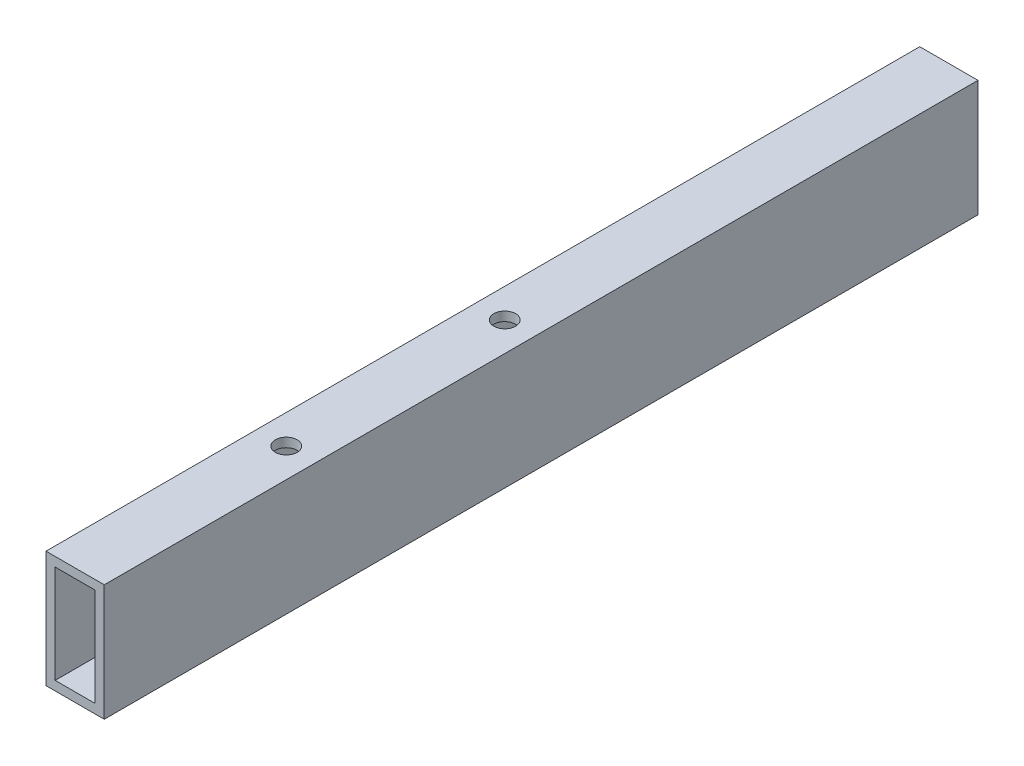
ISO-10303-21;
HEADER;
FILE_DESCRIPTION(('STEP AP214'),'2;1');
FILE_NAME('part.step','',(''),(''),'','','');
FILE_SCHEMA(('AUTOMOTIVE_DESIGN { 1 0 10303 214 1 1 1 1 }'));
ENDSEC;
DATA;
#1=APPLICATION_CONTEXT('core data for automotive mechanical design processes');
#2=APPLICATION_PROTOCOL_DEFINITION('international standard','automotive_design',2000,#1);
#3=PRODUCT_CONTEXT('',#1,'mechanical');
#4=PRODUCT('Part','Part','',(#3));
#5=PRODUCT_RELATED_PRODUCT_CATEGORY('part','',(#4));
#6=PRODUCT_DEFINITION_FORMATION('','',#4);
#7=PRODUCT_DEFINITION_CONTEXT('part definition',#1,'design');
#8=PRODUCT_DEFINITION('design','',#6,#7);
#9=PRODUCT_DEFINITION_SHAPE('','',#8);
#10=(LENGTH_UNIT() NAMED_UNIT(*) SI_UNIT(.MILLI.,.METRE.));
#11=(NAMED_UNIT(*) PLANE_ANGLE_UNIT() SI_UNIT($,.RADIAN.));
#12=(NAMED_UNIT(*) SI_UNIT($,.STERADIAN.) SOLID_ANGLE_UNIT());
#13=UNCERTAINTY_MEASURE_WITH_UNIT(LENGTH_MEASURE(1.E-05),#10,'distance_accuracy_value','');
#14=(GEOMETRIC_REPRESENTATION_CONTEXT(3) GLOBAL_UNCERTAINTY_ASSIGNED_CONTEXT((#13)) GLOBAL_UNIT_ASSIGNED_CONTEXT((#10,
#11,#12)) REPRESENTATION_CONTEXT('',''));
#15=CARTESIAN_POINT('',(0.,0.,0.));
#16=DIRECTION('',(0.,0.,1.));
#17=DIRECTION('',(1.,0.,0.));
#18=AXIS2_PLACEMENT_3D('',#15,#16,#17);
#19=CARTESIAN_POINT('',(-20.,40.,300.));
#20=DIRECTION('',(1.,0.,0.));
#21=DIRECTION('',(0.,0.,-1.));
#22=AXIS2_PLACEMENT_3D('',#19,#20,#21);
#23=PLANE('',#22);
#24=DIRECTION('',(0.,0.,-1.));
#25=VECTOR('',#24,1.);
#26=CARTESIAN_POINT('',(-20.,-40.,300.));
#27=LINE('',#26,#25);
#28=CARTESIAN_POINT('',(-20.,-40.,300.));
#29=VERTEX_POINT('',#28);
#30=CARTESIAN_POINT('',(-20.,-40.,-300.));
#31=VERTEX_POINT('',#30);
#32=EDGE_CURVE('E100',#29,#31,#27,.T.);
#33=ORIENTED_EDGE('',*,*,#32,.F.);
#34=DIRECTION('',(0.,-1.,0.));
#35=VECTOR('',#34,1.);
#36=CARTESIAN_POINT('',(-20.,40.,300.));
#37=LINE('',#36,#35);
#38=CARTESIAN_POINT('',(-20.,40.,300.));
#39=VERTEX_POINT('',#38);
#40=EDGE_CURVE('E88',#39,#29,#37,.T.);
#41=ORIENTED_EDGE('',*,*,#40,.F.);
#42=DIRECTION('',(0.,0.,-1.));
#43=VECTOR('',#42,1.);
#44=CARTESIAN_POINT('',(-20.,40.,300.));
#45=LINE('',#44,#43);
#46=CARTESIAN_POINT('',(-20.,40.,-300.));
#47=VERTEX_POINT('',#46);
#48=EDGE_CURVE('E105',#39,#47,#45,.T.);
#49=ORIENTED_EDGE('',*,*,#48,.T.);
#50=DIRECTION('',(0.,-1.,0.));
#51=VECTOR('',#50,1.);
#52=CARTESIAN_POINT('',(-20.,40.,-300.));
#53=LINE('',#52,#51);
#54=EDGE_CURVE('E101',#47,#31,#53,.T.);
#55=ORIENTED_EDGE('',*,*,#54,.T.);
#56=EDGE_LOOP('',(#33,#41,#49,#55));
#57=FACE_BOUND('',#56,.T.);
#58=ADVANCED_FACE('F36',(#57),#23,.F.);
#59=CARTESIAN_POINT('',(-20.,-40.,300.));
#60=DIRECTION('',(0.,1.,0.));
#61=DIRECTION('',(-1.,0.,0.));
#62=AXIS2_PLACEMENT_3D('',#59,#60,#61);
#63=PLANE('',#62);
#64=CARTESIAN_POINT('',(0.,-40.,155.));
#65=DIRECTION('',(0.,1.,0.));
#66=DIRECTION('',(0.,0.,1.));
#67=AXIS2_PLACEMENT_3D('',#64,#65,#66);
#68=CIRCLE('',#67,7.49999999999999);
#69=CARTESIAN_POINT('',(0.,-40.,162.5));
#70=VERTEX_POINT('',#69);
#71=EDGE_CURVE('E219',#70,#70,#68,.T.);
#72=ORIENTED_EDGE('',*,*,#71,.T.);
#73=EDGE_LOOP('',(#72));
#74=FACE_BOUND('',#73,.T.);
#75=CARTESIAN_POINT('',(0.,-40.,5.));
#76=DIRECTION('',(0.,1.,0.));
#77=DIRECTION('',(0.,0.,1.));
#78=AXIS2_PLACEMENT_3D('',#75,#76,#77);
#79=CIRCLE('',#78,7.49999999999999);
#80=CARTESIAN_POINT('',(0.,-40.,12.5));
#81=VERTEX_POINT('',#80);
#82=EDGE_CURVE('E124',#81,#81,#79,.T.);
#83=ORIENTED_EDGE('',*,*,#82,.T.);
#84=EDGE_LOOP('',(#83));
#85=FACE_BOUND('',#84,.T.);
#86=DIRECTION('',(0.,0.,-1.));
#87=VECTOR('',#86,1.);
#88=CARTESIAN_POINT('',(20.,-40.,300.));
#89=LINE('',#88,#87);
#90=CARTESIAN_POINT('',(20.,-40.,300.));
#91=VERTEX_POINT('',#90);
#92=CARTESIAN_POINT('',(20.,-40.,-300.));
#93=VERTEX_POINT('',#92);
#94=EDGE_CURVE('E104',#91,#93,#89,.T.);
#95=ORIENTED_EDGE('',*,*,#94,.F.);
#96=DIRECTION('',(1.,0.,0.));
#97=VECTOR('',#96,1.);
#98=CARTESIAN_POINT('',(-20.,-40.,300.));
#99=LINE('',#98,#97);
#100=EDGE_CURVE('E85',#29,#91,#99,.T.);
#101=ORIENTED_EDGE('',*,*,#100,.F.);
#102=ORIENTED_EDGE('',*,*,#32,.T.);
#103=DIRECTION('',(1.,0.,0.));
#104=VECTOR('',#103,1.);
#105=CARTESIAN_POINT('',(-20.,-40.,-300.));
#106=LINE('',#105,#104);
#107=EDGE_CURVE('E169',#31,#93,#106,.T.);
#108=ORIENTED_EDGE('',*,*,#107,.T.);
#109=EDGE_LOOP('',(#95,#101,#102,#108));
#110=FACE_BOUND('',#109,.T.);
#111=ADVANCED_FACE('F107',(#74,#85,#110),#63,.F.);
#112=CARTESIAN_POINT('',(20.,40.,300.));
#113=DIRECTION('',(-1.,0.,0.));
#114=DIRECTION('',(0.,-1.,0.));
#115=AXIS2_PLACEMENT_3D('',#112,#113,#114);
#116=PLANE('',#115);
#117=DIRECTION('',(0.,0.,-1.));
#118=VECTOR('',#117,1.);
#119=CARTESIAN_POINT('',(20.,40.,300.));
#120=LINE('',#119,#118);
#121=CARTESIAN_POINT('',(20.,40.,300.));
#122=VERTEX_POINT('',#121);
#123=CARTESIAN_POINT('',(20.,40.,-300.));
#124=VERTEX_POINT('',#123);
#125=EDGE_CURVE('E96',#122,#124,#120,.T.);
#126=ORIENTED_EDGE('',*,*,#125,.F.);
#127=DIRECTION('',(0.,1.,0.));
#128=VECTOR('',#127,1.);
#129=CARTESIAN_POINT('',(20.,40.,300.));
#130=LINE('',#129,#128);
#131=EDGE_CURVE('E110',#91,#122,#130,.T.);
#132=ORIENTED_EDGE('',*,*,#131,.F.);
#133=ORIENTED_EDGE('',*,*,#94,.T.);
#134=DIRECTION('',(0.,1.,0.));
#135=VECTOR('',#134,1.);
#136=CARTESIAN_POINT('',(20.,40.,-300.));
#137=LINE('',#136,#135);
#138=EDGE_CURVE('E114',#93,#124,#137,.T.);
#139=ORIENTED_EDGE('',*,*,#138,.T.);
#140=EDGE_LOOP('',(#126,#132,#133,#139));
#141=FACE_BOUND('',#140,.T.);
#142=ADVANCED_FACE('F176',(#141),#116,.F.);
#143=CARTESIAN_POINT('',(-20.,40.,300.));
#144=DIRECTION('',(0.,-1.,0.));
#145=DIRECTION('',(1.,0.,0.));
#146=AXIS2_PLACEMENT_3D('',#143,#144,#145);
#147=PLANE('',#146);
#148=CARTESIAN_POINT('',(0.,40.,155.));
#149=DIRECTION('',(0.,1.,0.));
#150=DIRECTION('',(0.,0.,1.));
#151=AXIS2_PLACEMENT_3D('',#148,#149,#150);
#152=CIRCLE('',#151,7.49999999999999);
#153=CARTESIAN_POINT('',(0.,40.,162.5));
#154=VERTEX_POINT('',#153);
#155=EDGE_CURVE('E221',#154,#154,#152,.T.);
#156=ORIENTED_EDGE('',*,*,#155,.F.);
#157=EDGE_LOOP('',(#156));
#158=FACE_BOUND('',#157,.T.);
#159=CARTESIAN_POINT('',(0.,40.,5.));
#160=DIRECTION('',(0.,1.,0.));
#161=DIRECTION('',(0.,0.,1.));
#162=AXIS2_PLACEMENT_3D('',#159,#160,#161);
#163=CIRCLE('',#162,7.49999999999999);
#164=CARTESIAN_POINT('',(0.,40.,12.5));
#165=VERTEX_POINT('',#164);
#166=EDGE_CURVE('E130',#165,#165,#163,.T.);
#167=ORIENTED_EDGE('',*,*,#166,.F.);
#168=EDGE_LOOP('',(#167));
#169=FACE_BOUND('',#168,.T.);
#170=DIRECTION('',(-1.,0.,0.));
#171=VECTOR('',#170,1.);
#172=CARTESIAN_POINT('',(-20.,40.,-300.));
#173=LINE('',#172,#171);
#174=EDGE_CURVE('E143',#124,#47,#173,.T.);
#175=ORIENTED_EDGE('',*,*,#174,.T.);
#176=ORIENTED_EDGE('',*,*,#48,.F.);
#177=DIRECTION('',(-1.,0.,0.));
#178=VECTOR('',#177,1.);
#179=CARTESIAN_POINT('',(-20.,40.,300.));
#180=LINE('',#179,#178);
#181=EDGE_CURVE('E92',#122,#39,#180,.T.);
#182=ORIENTED_EDGE('',*,*,#181,.F.);
#183=ORIENTED_EDGE('',*,*,#125,.T.);
#184=EDGE_LOOP('',(#175,#176,#182,#183));
#185=FACE_BOUND('',#184,.T.);
#186=ADVANCED_FACE('F38',(#158,#169,#185),#147,.F.);
#187=CARTESIAN_POINT('',(0.,0.,300.));
#188=DIRECTION('',(0.,0.,1.));
#189=DIRECTION('',(1.,0.,0.));
#190=AXIS2_PLACEMENT_3D('',#187,#188,#189);
#191=PLANE('',#190);
#192=DIRECTION('',(0.,-1.,0.));
#193=VECTOR('',#192,1.);
#194=CARTESIAN_POINT('',(-13.7,33.7,300.));
#195=LINE('',#194,#193);
#196=CARTESIAN_POINT('',(-13.7,-33.7,300.));
#197=VERTEX_POINT('',#196);
#198=CARTESIAN_POINT('',(-13.7,33.7,300.));
#199=VERTEX_POINT('',#198);
#200=EDGE_CURVE('E156',#197,#199,#195,.F.);
#201=ORIENTED_EDGE('',*,*,#200,.T.);
#202=DIRECTION('',(-1.,0.,0.));
#203=VECTOR('',#202,1.);
#204=CARTESIAN_POINT('',(-13.7,33.7,300.));
#205=LINE('',#204,#203);
#206=CARTESIAN_POINT('',(13.7,33.7,300.));
#207=VERTEX_POINT('',#206);
#208=EDGE_CURVE('E139',#199,#207,#205,.F.);
#209=ORIENTED_EDGE('',*,*,#208,.T.);
#210=DIRECTION('',(0.,1.,0.));
#211=VECTOR('',#210,1.);
#212=CARTESIAN_POINT('',(13.7,33.7,300.));
#213=LINE('',#212,#211);
#214=CARTESIAN_POINT('',(13.7,-33.7,300.));
#215=VERTEX_POINT('',#214);
#216=EDGE_CURVE('E142',#207,#215,#213,.F.);
#217=ORIENTED_EDGE('',*,*,#216,.T.);
#218=DIRECTION('',(1.,0.,0.));
#219=VECTOR('',#218,1.);
#220=CARTESIAN_POINT('',(-13.7,-33.7,300.));
#221=LINE('',#220,#219);
#222=EDGE_CURVE('E159',#215,#197,#221,.F.);
#223=ORIENTED_EDGE('',*,*,#222,.T.);
#224=EDGE_LOOP('',(#201,#209,#217,#223));
#225=FACE_BOUND('',#224,.T.);
#226=ORIENTED_EDGE('',*,*,#40,.T.);
#227=ORIENTED_EDGE('',*,*,#100,.T.);
#228=ORIENTED_EDGE('',*,*,#131,.T.);
#229=ORIENTED_EDGE('',*,*,#181,.T.);
#230=EDGE_LOOP('',(#226,#227,#228,#229));
#231=FACE_BOUND('',#230,.T.);
#232=ADVANCED_FACE('F90',(#225,#231),#191,.T.);
#233=CARTESIAN_POINT('',(0.,0.,-300.));
#234=DIRECTION('',(0.,0.,1.));
#235=DIRECTION('',(1.,0.,0.));
#236=AXIS2_PLACEMENT_3D('',#233,#234,#235);
#237=PLANE('',#236);
#238=DIRECTION('',(0.,-1.,0.));
#239=VECTOR('',#238,1.);
#240=CARTESIAN_POINT('',(-13.7,33.7,-300.));
#241=LINE('',#240,#239);
#242=CARTESIAN_POINT('',(-13.7,-33.7,-300.));
#243=VERTEX_POINT('',#242);
#244=CARTESIAN_POINT('',(-13.7,33.7,-300.));
#245=VERTEX_POINT('',#244);
#246=EDGE_CURVE('E11',#243,#245,#241,.F.);
#247=ORIENTED_EDGE('',*,*,#246,.F.);
#248=DIRECTION('',(1.,0.,0.));
#249=VECTOR('',#248,1.);
#250=CARTESIAN_POINT('',(-13.7,-33.7,-300.));
#251=LINE('',#250,#249);
#252=CARTESIAN_POINT('',(13.7,-33.7,-300.));
#253=VERTEX_POINT('',#252);
#254=EDGE_CURVE('E46',#253,#243,#251,.F.);
#255=ORIENTED_EDGE('',*,*,#254,.F.);
#256=DIRECTION('',(0.,1.,0.));
#257=VECTOR('',#256,1.);
#258=CARTESIAN_POINT('',(13.7,33.7,-300.));
#259=LINE('',#258,#257);
#260=CARTESIAN_POINT('',(13.7,33.7,-300.));
#261=VERTEX_POINT('',#260);
#262=EDGE_CURVE('E147',#261,#253,#259,.F.);
#263=ORIENTED_EDGE('',*,*,#262,.F.);
#264=DIRECTION('',(-1.,0.,0.));
#265=VECTOR('',#264,1.);
#266=CARTESIAN_POINT('',(-13.7,33.7,-300.));
#267=LINE('',#266,#265);
#268=EDGE_CURVE('E144',#245,#261,#267,.F.);
#269=ORIENTED_EDGE('',*,*,#268,.F.);
#270=EDGE_LOOP('',(#247,#255,#263,#269));
#271=FACE_BOUND('',#270,.T.);
#272=ORIENTED_EDGE('',*,*,#54,.F.);
#273=ORIENTED_EDGE('',*,*,#174,.F.);
#274=ORIENTED_EDGE('',*,*,#138,.F.);
#275=ORIENTED_EDGE('',*,*,#107,.F.);
#276=EDGE_LOOP('',(#272,#273,#274,#275));
#277=FACE_BOUND('',#276,.T.);
#278=ADVANCED_FACE('F178',(#271,#277),#237,.F.);
#279=CARTESIAN_POINT('',(-13.7,33.7,300.));
#280=DIRECTION('',(0.,1.,0.));
#281=DIRECTION('',(-1.,0.,0.));
#282=AXIS2_PLACEMENT_3D('',#279,#280,#281);
#283=PLANE('',#282);
#284=CARTESIAN_POINT('',(0.,33.7,155.));
#285=DIRECTION('',(0.,1.,0.));
#286=DIRECTION('',(-1.,0.,0.));
#287=AXIS2_PLACEMENT_3D('',#284,#285,#286);
#288=CIRCLE('',#287,7.49999999999999);
#289=CARTESIAN_POINT('',(-7.49999999999999,33.7,155.));
#290=VERTEX_POINT('',#289);
#291=EDGE_CURVE('E40',#290,#290,#288,.T.);
#292=ORIENTED_EDGE('',*,*,#291,.T.);
#293=EDGE_LOOP('',(#292));
#294=FACE_BOUND('',#293,.T.);
#295=CARTESIAN_POINT('',(0.,33.7,5.));
#296=DIRECTION('',(0.,1.,0.));
#297=DIRECTION('',(-1.,0.,0.));
#298=AXIS2_PLACEMENT_3D('',#295,#296,#297);
#299=CIRCLE('',#298,7.49999999999999);
#300=CARTESIAN_POINT('',(-7.49999999999999,33.7,5.));
#301=VERTEX_POINT('',#300);
#302=EDGE_CURVE('E122',#301,#301,#299,.T.);
#303=ORIENTED_EDGE('',*,*,#302,.T.);
#304=EDGE_LOOP('',(#303));
#305=FACE_BOUND('',#304,.T.);
#306=DIRECTION('',(0.,0.,-1.));
#307=VECTOR('',#306,1.);
#308=CARTESIAN_POINT('',(13.7,33.7,300.));
#309=LINE('',#308,#307);
#310=EDGE_CURVE('E149',#207,#261,#309,.T.);
#311=ORIENTED_EDGE('',*,*,#310,.F.);
#312=ORIENTED_EDGE('',*,*,#208,.F.);
#313=DIRECTION('',(0.,0.,-1.));
#314=VECTOR('',#313,1.);
#315=CARTESIAN_POINT('',(-13.7,33.7,300.));
#316=LINE('',#315,#314);
#317=EDGE_CURVE('E153',#199,#245,#316,.T.);
#318=ORIENTED_EDGE('',*,*,#317,.T.);
#319=ORIENTED_EDGE('',*,*,#268,.T.);
#320=EDGE_LOOP('',(#311,#312,#318,#319));
#321=FACE_BOUND('',#320,.T.);
#322=ADVANCED_FACE('F208',(#294,#305,#321),#283,.F.);
#323=CARTESIAN_POINT('',(13.7,33.7,300.));
#324=DIRECTION('',(1.,0.,0.));
#325=DIRECTION('',(0.,0.,-1.));
#326=AXIS2_PLACEMENT_3D('',#323,#324,#325);
#327=PLANE('',#326);
#328=DIRECTION('',(0.,0.,-1.));
#329=VECTOR('',#328,1.);
#330=CARTESIAN_POINT('',(13.7,-33.7,300.));
#331=LINE('',#330,#329);
#332=EDGE_CURVE('E152',#215,#253,#331,.T.);
#333=ORIENTED_EDGE('',*,*,#332,.F.);
#334=ORIENTED_EDGE('',*,*,#216,.F.);
#335=ORIENTED_EDGE('',*,*,#310,.T.);
#336=ORIENTED_EDGE('',*,*,#262,.T.);
#337=EDGE_LOOP('',(#333,#334,#335,#336));
#338=FACE_BOUND('',#337,.T.);
#339=ADVANCED_FACE('F202',(#338),#327,.F.);
#340=CARTESIAN_POINT('',(-13.7,-33.7,300.));
#341=DIRECTION('',(0.,-1.,0.));
#342=DIRECTION('',(1.,0.,0.));
#343=AXIS2_PLACEMENT_3D('',#340,#341,#342);
#344=PLANE('',#343);
#345=CARTESIAN_POINT('',(0.,-33.7,155.));
#346=DIRECTION('',(0.,-1.,0.));
#347=DIRECTION('',(1.,0.,0.));
#348=AXIS2_PLACEMENT_3D('',#345,#346,#347);
#349=CIRCLE('',#348,7.49999999999999);
#350=CARTESIAN_POINT('',(7.49999999999998,-33.7,155.));
#351=VERTEX_POINT('',#350);
#352=EDGE_CURVE('E135',#351,#351,#349,.T.);
#353=ORIENTED_EDGE('',*,*,#352,.T.);
#354=EDGE_LOOP('',(#353));
#355=FACE_BOUND('',#354,.T.);
#356=CARTESIAN_POINT('',(0.,-33.7,5.));
#357=DIRECTION('',(0.,-1.,0.));
#358=DIRECTION('',(1.,0.,0.));
#359=AXIS2_PLACEMENT_3D('',#356,#357,#358);
#360=CIRCLE('',#359,7.49999999999999);
#361=CARTESIAN_POINT('',(7.49999999999998,-33.7,5.));
#362=VERTEX_POINT('',#361);
#363=EDGE_CURVE('E119',#362,#362,#360,.T.);
#364=ORIENTED_EDGE('',*,*,#363,.T.);
#365=EDGE_LOOP('',(#364));
#366=FACE_BOUND('',#365,.T.);
#367=DIRECTION('',(0.,0.,-1.));
#368=VECTOR('',#367,1.);
#369=CARTESIAN_POINT('',(-13.7,-33.7,300.));
#370=LINE('',#369,#368);
#371=EDGE_CURVE('E148',#197,#243,#370,.T.);
#372=ORIENTED_EDGE('',*,*,#371,.F.);
#373=ORIENTED_EDGE('',*,*,#222,.F.);
#374=ORIENTED_EDGE('',*,*,#332,.T.);
#375=ORIENTED_EDGE('',*,*,#254,.T.);
#376=EDGE_LOOP('',(#372,#373,#374,#375));
#377=FACE_BOUND('',#376,.T.);
#378=ADVANCED_FACE('F192',(#355,#366,#377),#344,.F.);
#379=CARTESIAN_POINT('',(-13.7,33.7,300.));
#380=DIRECTION('',(-1.,0.,0.));
#381=DIRECTION('',(0.,0.,1.));
#382=AXIS2_PLACEMENT_3D('',#379,#380,#381);
#383=PLANE('',#382);
#384=ORIENTED_EDGE('',*,*,#246,.T.);
#385=ORIENTED_EDGE('',*,*,#317,.F.);
#386=ORIENTED_EDGE('',*,*,#200,.F.);
#387=ORIENTED_EDGE('',*,*,#371,.T.);
#388=EDGE_LOOP('',(#384,#385,#386,#387));
#389=FACE_BOUND('',#388,.T.);
#390=ADVANCED_FACE('F189',(#389),#383,.F.);
#391=CARTESIAN_POINT('',(0.,40.,5.));
#392=DIRECTION('',(0.,1.,0.));
#393=DIRECTION('',(0.,0.,1.));
#394=AXIS2_PLACEMENT_3D('',#391,#392,#393);
#395=CYLINDRICAL_SURFACE('',#394,7.49999999999999);
#396=ORIENTED_EDGE('',*,*,#166,.T.);
#397=EDGE_LOOP('',(#396));
#398=FACE_BOUND('',#397,.T.);
#399=ORIENTED_EDGE('',*,*,#302,.F.);
#400=EDGE_LOOP('',(#399));
#401=FACE_BOUND('',#400,.T.);
#402=ADVANCED_FACE('F191',(#398,#401),#395,.F.);
#403=ORIENTED_EDGE('',*,*,#82,.F.);
#404=EDGE_LOOP('',(#403));
#405=FACE_BOUND('',#404,.T.);
#406=ORIENTED_EDGE('',*,*,#363,.F.);
#407=EDGE_LOOP('',(#406));
#408=FACE_BOUND('',#407,.T.);
#409=ADVANCED_FACE('F199',(#405,#408),#395,.F.);
#410=CARTESIAN_POINT('',(0.,40.,155.));
#411=DIRECTION('',(0.,1.,0.));
#412=DIRECTION('',(0.,0.,1.));
#413=AXIS2_PLACEMENT_3D('',#410,#411,#412);
#414=CYLINDRICAL_SURFACE('',#413,7.49999999999999);
#415=ORIENTED_EDGE('',*,*,#155,.T.);
#416=EDGE_LOOP('',(#415));
#417=FACE_BOUND('',#416,.T.);
#418=ORIENTED_EDGE('',*,*,#291,.F.);
#419=EDGE_LOOP('',(#418));
#420=FACE_BOUND('',#419,.T.);
#421=ADVANCED_FACE('F232',(#417,#420),#414,.F.);
#422=ORIENTED_EDGE('',*,*,#71,.F.);
#423=EDGE_LOOP('',(#422));
#424=FACE_BOUND('',#423,.T.);
#425=ORIENTED_EDGE('',*,*,#352,.F.);
#426=EDGE_LOOP('',(#425));
#427=FACE_BOUND('',#426,.T.);
#428=ADVANCED_FACE('F230',(#424,#427),#414,.F.);
#429=CLOSED_SHELL('',(#58,#111,#142,#186,#232,#278,#322,#339,#378,#390,#402,#409,#421,#428));
#430=MANIFOLD_SOLID_BREP('B2',#429);
#431=ADVANCED_BREP_SHAPE_REPRESENTATION('',(#18,#430),#14);
#432=SHAPE_DEFINITION_REPRESENTATION(#9,#431);
ENDSEC;
END-ISO-10303-21;
